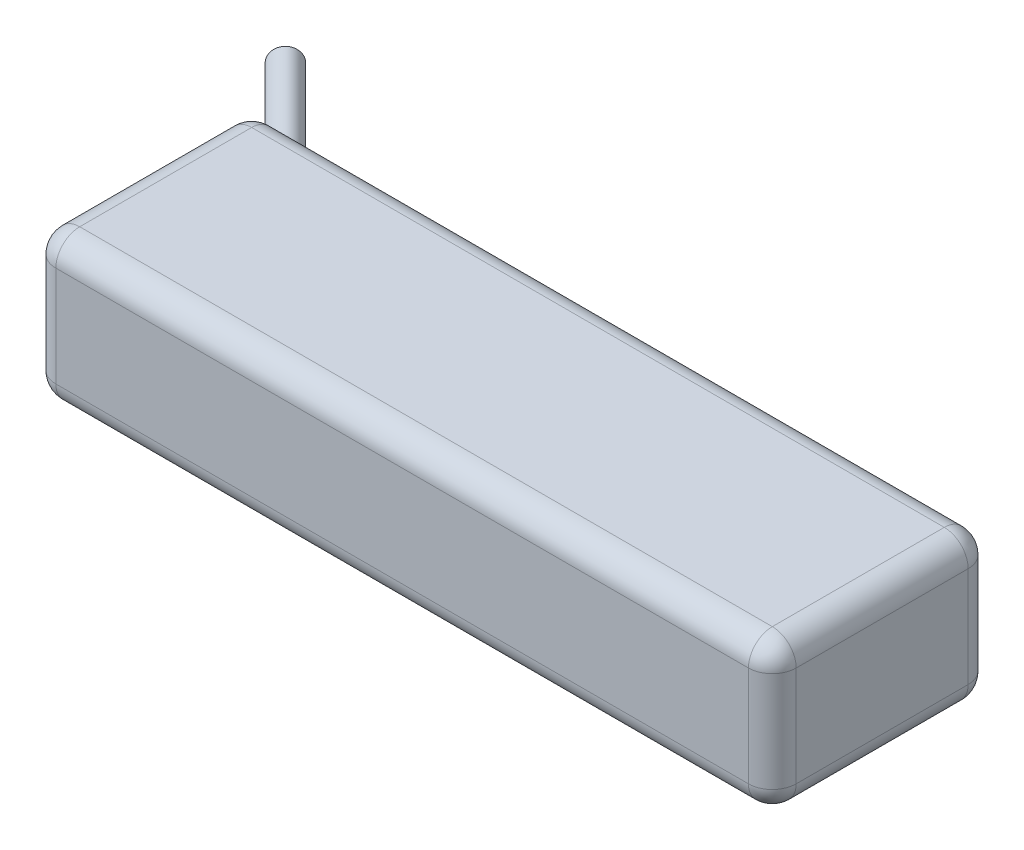
ISO-10303-21;
HEADER;
FILE_DESCRIPTION(('STEP AP214'),'2;1');
FILE_NAME('part.step','',(''),(''),'','','');
FILE_SCHEMA(('AUTOMOTIVE_DESIGN { 1 0 10303 214 1 1 1 1 }'));
ENDSEC;
DATA;
#1=APPLICATION_CONTEXT('core data for automotive mechanical design processes');
#2=APPLICATION_PROTOCOL_DEFINITION('international standard','automotive_design',2000,#1);
#3=PRODUCT_CONTEXT('',#1,'mechanical');
#4=PRODUCT('Part','Part','',(#3));
#5=PRODUCT_RELATED_PRODUCT_CATEGORY('part','',(#4));
#6=PRODUCT_DEFINITION_FORMATION('','',#4);
#7=PRODUCT_DEFINITION_CONTEXT('part definition',#1,'design');
#8=PRODUCT_DEFINITION('design','',#6,#7);
#9=PRODUCT_DEFINITION_SHAPE('','',#8);
#10=(LENGTH_UNIT() NAMED_UNIT(*) SI_UNIT(.MILLI.,.METRE.));
#11=(NAMED_UNIT(*) PLANE_ANGLE_UNIT() SI_UNIT($,.RADIAN.));
#12=(NAMED_UNIT(*) SI_UNIT($,.STERADIAN.) SOLID_ANGLE_UNIT());
#13=UNCERTAINTY_MEASURE_WITH_UNIT(LENGTH_MEASURE(1.E-05),#10,'distance_accuracy_value','');
#14=(GEOMETRIC_REPRESENTATION_CONTEXT(3) GLOBAL_UNCERTAINTY_ASSIGNED_CONTEXT((#13)) GLOBAL_UNIT_ASSIGNED_CONTEXT((#10,
#11,#12)) REPRESENTATION_CONTEXT('',''));
#15=CARTESIAN_POINT('',(0.,0.,0.));
#16=DIRECTION('',(0.,0.,1.));
#17=DIRECTION('',(1.,0.,0.));
#18=AXIS2_PLACEMENT_3D('',#15,#16,#17);
#19=CARTESIAN_POINT('',(77.5,15.5,-23.));
#20=DIRECTION('',(-1.,0.,0.));
#21=DIRECTION('',(0.,0.,1.));
#22=AXIS2_PLACEMENT_3D('',#19,#20,#21);
#23=PLANE('',#22);
#24=DIRECTION('',(0.,-1.,0.));
#25=VECTOR('',#24,1.);
#26=CARTESIAN_POINT('',(77.5,15.5,18.));
#27=LINE('',#26,#25);
#28=CARTESIAN_POINT('',(77.5,10.5,18.));
#29=VERTEX_POINT('',#28);
#30=CARTESIAN_POINT('',(77.5,-10.5,18.));
#31=VERTEX_POINT('',#30);
#32=EDGE_CURVE('E205',#29,#31,#27,.T.);
#33=ORIENTED_EDGE('',*,*,#32,.T.);
#34=DIRECTION('',(0.,0.,-1.));
#35=VECTOR('',#34,1.);
#36=CARTESIAN_POINT('',(77.5,-10.5,-23.));
#37=LINE('',#36,#35);
#38=CARTESIAN_POINT('',(77.5,-10.5,-18.));
#39=VERTEX_POINT('',#38);
#40=EDGE_CURVE('E210',#31,#39,#37,.T.);
#41=ORIENTED_EDGE('',*,*,#40,.T.);
#42=DIRECTION('',(0.,-1.,0.));
#43=VECTOR('',#42,1.);
#44=CARTESIAN_POINT('',(77.5,15.5,-18.));
#45=LINE('',#44,#43);
#46=CARTESIAN_POINT('',(77.5,10.5,-18.));
#47=VERTEX_POINT('',#46);
#48=EDGE_CURVE('E207',#39,#47,#45,.F.);
#49=ORIENTED_EDGE('',*,*,#48,.T.);
#50=DIRECTION('',(0.,0.,-1.));
#51=VECTOR('',#50,1.);
#52=CARTESIAN_POINT('',(77.5,10.5,23.));
#53=LINE('',#52,#51);
#54=EDGE_CURVE('E203',#47,#29,#53,.F.);
#55=ORIENTED_EDGE('',*,*,#54,.T.);
#56=EDGE_LOOP('',(#33,#41,#49,#55));
#57=FACE_BOUND('',#56,.T.);
#58=ADVANCED_FACE('F41',(#57),#23,.F.);
#59=CARTESIAN_POINT('',(-77.5,15.5,-23.));
#60=DIRECTION('',(0.,0.,1.));
#61=DIRECTION('',(1.,0.,0.));
#62=AXIS2_PLACEMENT_3D('',#59,#60,#61);
#63=PLANE('',#62);
#64=CARTESIAN_POINT('',(-70.4289321881345,-6.,-23.));
#65=DIRECTION('',(0.,0.,1.));
#66=DIRECTION('',(1.,0.,0.));
#67=AXIS2_PLACEMENT_3D('',#64,#65,#66);
#68=ELLIPSE('',#67,4.24264068711925,2.99999999999999);
#69=CARTESIAN_POINT('',(-67.4999999999999,-3.82959033391061,-23.));
#70=VERTEX_POINT('',#69);
#71=CARTESIAN_POINT('',(-72.5,-3.38172975815573,-23.));
#72=VERTEX_POINT('',#71);
#73=EDGE_CURVE('E164',#70,#72,#68,.T.);
#74=ORIENTED_EDGE('',*,*,#73,.T.);
#75=DIRECTION('',(0.,-1.,0.));
#76=VECTOR('',#75,1.);
#77=CARTESIAN_POINT('',(-72.5,15.5,-23.));
#78=LINE('',#77,#76);
#79=CARTESIAN_POINT('',(-72.5,3.3817297581557,-23.));
#80=VERTEX_POINT('',#79);
#81=EDGE_CURVE('E201',#72,#80,#78,.F.);
#82=ORIENTED_EDGE('',*,*,#81,.T.);
#83=CARTESIAN_POINT('',(-70.4289321881345,6.,-23.));
#84=DIRECTION('',(0.,0.,1.));
#85=DIRECTION('',(1.,0.,0.));
#86=AXIS2_PLACEMENT_3D('',#83,#84,#85);
#87=ELLIPSE('',#86,4.24264068711927,3.);
#88=CARTESIAN_POINT('',(-67.4999999999999,3.82959033391058,-23.));
#89=VERTEX_POINT('',#88);
#90=EDGE_CURVE('E188',#80,#89,#87,.T.);
#91=ORIENTED_EDGE('',*,*,#90,.T.);
#92=DIRECTION('',(0.,1.,0.));
#93=VECTOR('',#92,1.);
#94=CARTESIAN_POINT('',(-67.4999999999999,15.5,-23.));
#95=LINE('',#94,#93);
#96=CARTESIAN_POINT('',(-67.4999999999999,8.17040966608942,-23.));
#97=VERTEX_POINT('',#96);
#98=EDGE_CURVE('E184',#89,#97,#95,.T.);
#99=ORIENTED_EDGE('',*,*,#98,.T.);
#100=CARTESIAN_POINT('',(-72.5,8.61827024184429,-23.));
#101=VERTEX_POINT('',#100);
#102=EDGE_CURVE('E170',#97,#101,#87,.T.);
#103=ORIENTED_EDGE('',*,*,#102,.T.);
#104=DIRECTION('',(0.,-1.,0.));
#105=VECTOR('',#104,1.);
#106=CARTESIAN_POINT('',(-72.5,15.5,-23.));
#107=LINE('',#106,#105);
#108=CARTESIAN_POINT('',(-72.5,10.5,-23.));
#109=VERTEX_POINT('',#108);
#110=EDGE_CURVE('E193',#101,#109,#107,.F.);
#111=ORIENTED_EDGE('',*,*,#110,.T.);
#112=DIRECTION('',(-1.,0.,0.));
#113=VECTOR('',#112,1.);
#114=CARTESIAN_POINT('',(77.5,10.5,-23.));
#115=LINE('',#114,#113);
#116=CARTESIAN_POINT('',(72.5,10.5,-23.));
#117=VERTEX_POINT('',#116);
#118=EDGE_CURVE('E191',#109,#117,#115,.F.);
#119=ORIENTED_EDGE('',*,*,#118,.T.);
#120=DIRECTION('',(0.,-1.,0.));
#121=VECTOR('',#120,1.);
#122=CARTESIAN_POINT('',(72.5,15.5,-23.));
#123=LINE('',#122,#121);
#124=CARTESIAN_POINT('',(72.5,-10.5,-23.));
#125=VERTEX_POINT('',#124);
#126=EDGE_CURVE('E195',#117,#125,#123,.T.);
#127=ORIENTED_EDGE('',*,*,#126,.T.);
#128=DIRECTION('',(-1.,0.,0.));
#129=VECTOR('',#128,1.);
#130=CARTESIAN_POINT('',(-77.5,-10.5,-23.));
#131=LINE('',#130,#129);
#132=CARTESIAN_POINT('',(-72.5,-10.5,-23.));
#133=VERTEX_POINT('',#132);
#134=EDGE_CURVE('E198',#125,#133,#131,.T.);
#135=ORIENTED_EDGE('',*,*,#134,.T.);
#136=DIRECTION('',(0.,-1.,0.));
#137=VECTOR('',#136,1.);
#138=CARTESIAN_POINT('',(-72.5,15.5,-23.));
#139=LINE('',#138,#137);
#140=CARTESIAN_POINT('',(-72.5,-8.61827024184429,-23.));
#141=VERTEX_POINT('',#140);
#142=EDGE_CURVE('E160',#133,#141,#139,.F.);
#143=ORIENTED_EDGE('',*,*,#142,.T.);
#144=CARTESIAN_POINT('',(-67.4999999999999,-8.1704096660894,-23.));
#145=VERTEX_POINT('',#144);
#146=EDGE_CURVE('E154',#141,#145,#68,.T.);
#147=ORIENTED_EDGE('',*,*,#146,.T.);
#148=DIRECTION('',(0.,1.,0.));
#149=VECTOR('',#148,1.);
#150=CARTESIAN_POINT('',(-67.4999999999999,15.5,-23.));
#151=LINE('',#150,#149);
#152=EDGE_CURVE('E158',#145,#70,#151,.T.);
#153=ORIENTED_EDGE('',*,*,#152,.T.);
#154=EDGE_LOOP('',(#74,#82,#91,#99,#103,#111,#119,#127,#135,#143,#147,#153));
#155=FACE_BOUND('',#154,.T.);
#156=ADVANCED_FACE('F157',(#155),#63,.F.);
#157=CARTESIAN_POINT('',(-77.5,15.5,-23.));
#158=DIRECTION('',(1.,0.,0.));
#159=DIRECTION('',(0.,0.,-1.));
#160=AXIS2_PLACEMENT_3D('',#157,#158,#159);
#161=PLANE('',#160);
#162=DIRECTION('',(0.,-1.,0.));
#163=VECTOR('',#162,1.);
#164=CARTESIAN_POINT('',(-77.5,15.5,-18.));
#165=LINE('',#164,#163);
#166=CARTESIAN_POINT('',(-77.5,10.5,-18.));
#167=VERTEX_POINT('',#166);
#168=CARTESIAN_POINT('',(-77.5,-10.5,-18.));
#169=VERTEX_POINT('',#168);
#170=EDGE_CURVE('E216',#167,#169,#165,.T.);
#171=ORIENTED_EDGE('',*,*,#170,.T.);
#172=DIRECTION('',(0.,0.,1.));
#173=VECTOR('',#172,1.);
#174=CARTESIAN_POINT('',(-77.5,-10.5,-23.));
#175=LINE('',#174,#173);
#176=CARTESIAN_POINT('',(-77.5,-10.5,18.));
#177=VERTEX_POINT('',#176);
#178=EDGE_CURVE('E219',#169,#177,#175,.T.);
#179=ORIENTED_EDGE('',*,*,#178,.T.);
#180=DIRECTION('',(0.,-1.,0.));
#181=VECTOR('',#180,1.);
#182=CARTESIAN_POINT('',(-77.5,15.5,18.));
#183=LINE('',#182,#181);
#184=CARTESIAN_POINT('',(-77.5,10.5,18.));
#185=VERTEX_POINT('',#184);
#186=EDGE_CURVE('E214',#177,#185,#183,.F.);
#187=ORIENTED_EDGE('',*,*,#186,.T.);
#188=DIRECTION('',(0.,0.,1.));
#189=VECTOR('',#188,1.);
#190=CARTESIAN_POINT('',(-77.5,10.5,-23.));
#191=LINE('',#190,#189);
#192=EDGE_CURVE('E212',#185,#167,#191,.F.);
#193=ORIENTED_EDGE('',*,*,#192,.T.);
#194=EDGE_LOOP('',(#171,#179,#187,#193));
#195=FACE_BOUND('',#194,.T.);
#196=ADVANCED_FACE('F289',(#195),#161,.F.);
#197=CARTESIAN_POINT('',(-77.5,15.5,23.));
#198=DIRECTION('',(0.,0.,-1.));
#199=DIRECTION('',(-1.,0.,0.));
#200=AXIS2_PLACEMENT_3D('',#197,#198,#199);
#201=PLANE('',#200);
#202=DIRECTION('',(0.,-1.,0.));
#203=VECTOR('',#202,1.);
#204=CARTESIAN_POINT('',(-72.5,15.5,23.));
#205=LINE('',#204,#203);
#206=CARTESIAN_POINT('',(-72.5,10.5,23.));
#207=VERTEX_POINT('',#206);
#208=CARTESIAN_POINT('',(-72.5,-10.5,23.));
#209=VERTEX_POINT('',#208);
#210=EDGE_CURVE('E225',#207,#209,#205,.T.);
#211=ORIENTED_EDGE('',*,*,#210,.T.);
#212=DIRECTION('',(1.,0.,0.));
#213=VECTOR('',#212,1.);
#214=CARTESIAN_POINT('',(-77.5,-10.5,23.));
#215=LINE('',#214,#213);
#216=CARTESIAN_POINT('',(72.5,-10.5,23.));
#217=VERTEX_POINT('',#216);
#218=EDGE_CURVE('E228',#209,#217,#215,.T.);
#219=ORIENTED_EDGE('',*,*,#218,.T.);
#220=DIRECTION('',(0.,-1.,0.));
#221=VECTOR('',#220,1.);
#222=CARTESIAN_POINT('',(72.5,15.5,23.));
#223=LINE('',#222,#221);
#224=CARTESIAN_POINT('',(72.5,10.5,23.));
#225=VERTEX_POINT('',#224);
#226=EDGE_CURVE('E223',#217,#225,#223,.F.);
#227=ORIENTED_EDGE('',*,*,#226,.T.);
#228=DIRECTION('',(1.,0.,0.));
#229=VECTOR('',#228,1.);
#230=CARTESIAN_POINT('',(-77.5,10.5,23.));
#231=LINE('',#230,#229);
#232=EDGE_CURVE('E221',#225,#207,#231,.F.);
#233=ORIENTED_EDGE('',*,*,#232,.T.);
#234=EDGE_LOOP('',(#211,#219,#227,#233));
#235=FACE_BOUND('',#234,.T.);
#236=ADVANCED_FACE('F283',(#235),#201,.F.);
#237=CARTESIAN_POINT('',(0.,15.5,0.));
#238=DIRECTION('',(0.,1.,0.));
#239=DIRECTION('',(0.,0.,1.));
#240=AXIS2_PLACEMENT_3D('',#237,#238,#239);
#241=PLANE('',#240);
#242=DIRECTION('',(0.,0.,1.));
#243=VECTOR('',#242,1.);
#244=CARTESIAN_POINT('',(-72.5,15.5,23.));
#245=LINE('',#244,#243);
#246=CARTESIAN_POINT('',(-72.5,15.5,-18.));
#247=VERTEX_POINT('',#246);
#248=CARTESIAN_POINT('',(-72.5,15.5,18.));
#249=VERTEX_POINT('',#248);
#250=EDGE_CURVE('E58',#247,#249,#245,.T.);
#251=ORIENTED_EDGE('',*,*,#250,.T.);
#252=DIRECTION('',(1.,0.,0.));
#253=VECTOR('',#252,1.);
#254=CARTESIAN_POINT('',(77.5,15.5,18.));
#255=LINE('',#254,#253);
#256=CARTESIAN_POINT('',(72.5,15.5,18.));
#257=VERTEX_POINT('',#256);
#258=EDGE_CURVE('E243',#249,#257,#255,.T.);
#259=ORIENTED_EDGE('',*,*,#258,.T.);
#260=DIRECTION('',(0.,0.,-1.));
#261=VECTOR('',#260,1.);
#262=CARTESIAN_POINT('',(72.5,15.5,-23.));
#263=LINE('',#262,#261);
#264=CARTESIAN_POINT('',(72.5,15.5,-18.));
#265=VERTEX_POINT('',#264);
#266=EDGE_CURVE('E239',#257,#265,#263,.T.);
#267=ORIENTED_EDGE('',*,*,#266,.T.);
#268=DIRECTION('',(-1.,0.,0.));
#269=VECTOR('',#268,1.);
#270=CARTESIAN_POINT('',(-77.5,15.5,-18.));
#271=LINE('',#270,#269);
#272=EDGE_CURVE('E63',#265,#247,#271,.T.);
#273=ORIENTED_EDGE('',*,*,#272,.T.);
#274=EDGE_LOOP('',(#251,#259,#267,#273));
#275=FACE_BOUND('',#274,.T.);
#276=ADVANCED_FACE('F280',(#275),#241,.T.);
#277=CARTESIAN_POINT('',(0.,-15.5,0.));
#278=DIRECTION('',(0.,1.,0.));
#279=DIRECTION('',(0.,0.,1.));
#280=AXIS2_PLACEMENT_3D('',#277,#278,#279);
#281=PLANE('',#280);
#282=DIRECTION('',(0.,0.,1.));
#283=VECTOR('',#282,1.);
#284=CARTESIAN_POINT('',(-72.5,-15.5,0.));
#285=LINE('',#284,#283);
#286=CARTESIAN_POINT('',(-72.5,-15.5,18.));
#287=VERTEX_POINT('',#286);
#288=CARTESIAN_POINT('',(-72.5,-15.5,-18.));
#289=VERTEX_POINT('',#288);
#290=EDGE_CURVE('E234',#287,#289,#285,.F.);
#291=ORIENTED_EDGE('',*,*,#290,.T.);
#292=DIRECTION('',(-1.,0.,0.));
#293=VECTOR('',#292,1.);
#294=CARTESIAN_POINT('',(0.,-15.5,-18.));
#295=LINE('',#294,#293);
#296=CARTESIAN_POINT('',(72.5,-15.5,-18.));
#297=VERTEX_POINT('',#296);
#298=EDGE_CURVE('E236',#289,#297,#295,.F.);
#299=ORIENTED_EDGE('',*,*,#298,.T.);
#300=DIRECTION('',(0.,0.,-1.));
#301=VECTOR('',#300,1.);
#302=CARTESIAN_POINT('',(72.5,-15.5,0.));
#303=LINE('',#302,#301);
#304=CARTESIAN_POINT('',(72.5,-15.5,18.));
#305=VERTEX_POINT('',#304);
#306=EDGE_CURVE('E230',#297,#305,#303,.F.);
#307=ORIENTED_EDGE('',*,*,#306,.T.);
#308=DIRECTION('',(1.,0.,0.));
#309=VECTOR('',#308,1.);
#310=CARTESIAN_POINT('',(0.,-15.5,18.));
#311=LINE('',#310,#309);
#312=EDGE_CURVE('E232',#305,#287,#311,.F.);
#313=ORIENTED_EDGE('',*,*,#312,.T.);
#314=EDGE_LOOP('',(#291,#299,#307,#313));
#315=FACE_BOUND('',#314,.T.);
#316=ADVANCED_FACE('F278',(#315),#281,.F.);
#317=CARTESIAN_POINT('',(-90.1776695296636,6.,-42.7487373415292));
#318=DIRECTION('',(0.707106781186544,0.,0.707106781186551));
#319=DIRECTION('',(0.707106781186551,0.,-0.707106781186544));
#320=AXIS2_PLACEMENT_3D('',#317,#318,#319);
#321=CYLINDRICAL_SURFACE('',#320,3.);
#322=CARTESIAN_POINT('',(-90.1776695296636,6.,-42.7487373415292));
#323=DIRECTION('',(0.707106781186544,0.,0.707106781186551));
#324=DIRECTION('',(0.707106781186551,0.,-0.707106781186544));
#325=AXIS2_PLACEMENT_3D('',#322,#323,#324);
#326=CIRCLE('',#325,3.);
#327=CARTESIAN_POINT('',(-88.0563491861039,6.,-44.8700576850888));
#328=VERTEX_POINT('',#327);
#329=EDGE_CURVE('E181',#328,#328,#326,.T.);
#330=ORIENTED_EDGE('',*,*,#329,.T.);
#331=EDGE_LOOP('',(#330));
#332=FACE_BOUND('',#331,.T.);
#333=ORIENTED_EDGE('',*,*,#102,.F.);
#334=CARTESIAN_POINT('',(-68.9644660940672,6.,-21.5355339059327));
#335=DIRECTION('',(0.707106781186544,0.,0.707106781186551));
#336=DIRECTION('',(0.707106781186551,0.,-0.707106781186544));
#337=AXIS2_PLACEMENT_3D('',#334,#335,#336);
#338=CIRCLE('',#337,3.);
#339=EDGE_CURVE('E176',#89,#97,#338,.T.);
#340=ORIENTED_EDGE('',*,*,#339,.F.);
#341=ORIENTED_EDGE('',*,*,#90,.F.);
#342=CARTESIAN_POINT('',(-72.5,3.3817297581557,-23.));
#343=CARTESIAN_POINT('',(-72.5742723367273,3.41108832496102,-23.0000159399462));
#344=CARTESIAN_POINT('',(-72.6476207025028,3.44284189234237,-22.9983455721439));
#345=CARTESIAN_POINT('',(-72.7918514548512,3.51135555776492,-22.9919929695657));
#346=CARTESIAN_POINT('',(-72.8627324692063,3.54811838757358,-22.987309086166));
#347=CARTESIAN_POINT('',(-73.0013738349952,3.62686159193329,-22.9752869767334));
#348=CARTESIAN_POINT('',(-73.0691320776828,3.66884542336693,-22.9679469858548));
#349=CARTESIAN_POINT('',(-73.2008044407651,3.7580513502681,-22.9510883121884));
#350=CARTESIAN_POINT('',(-73.2647194086501,3.80527228430799,-22.9415701119641));
#351=CARTESIAN_POINT('',(-73.3883498792829,3.90508416188707,-22.9208515990757));
#352=CARTESIAN_POINT('',(-73.4480477003386,3.95769568272804,-22.9096447576015));
#353=CARTESIAN_POINT('',(-73.5624289240457,4.06794124194849,-22.8861698458924));
#354=CARTESIAN_POINT('',(-73.6171104014602,4.12557719225443,-22.8739013716917));
#355=CARTESIAN_POINT('',(-73.720877648095,4.24542484669456,-22.8489486158682));
#356=CARTESIAN_POINT('',(-73.7699731825568,4.30762824272717,-22.8362651113942));
#357=CARTESIAN_POINT('',(-73.8623256924469,4.43626971139602,-22.8110662623183));
#358=CARTESIAN_POINT('',(-73.9055805192486,4.50270932925477,-22.7985509811173));
#359=CARTESIAN_POINT('',(-74.0216641364888,4.70003719530852,-22.7634914472142));
#360=CARTESIAN_POINT('',(-74.0866844429277,4.83580851525652,-22.7419004637254));
#361=CARTESIAN_POINT('',(-74.1938158361093,5.11688746130414,-22.7047030515143));
#362=CARTESIAN_POINT('',(-74.2359108140236,5.26220171275287,-22.6891008331548));
#363=CARTESIAN_POINT('',(-74.2969896532276,5.55896345294547,-22.6660375615635));
#364=CARTESIAN_POINT('',(-74.315863433376,5.71043666512147,-22.6586153029766));
#365=CARTESIAN_POINT('',(-74.3300464396259,6.01461913202763,-22.6530623769069));
#366=CARTESIAN_POINT('',(-74.3253590100612,6.1673282082643,-22.6549303907405));
#367=CARTESIAN_POINT('',(-74.2922105447137,6.47195434588734,-22.6677940262898));
#368=CARTESIAN_POINT('',(-74.2634148923934,6.62382980628909,-22.6789181066376));
#369=CARTESIAN_POINT('',(-74.1817621463717,6.92018488185417,-22.7088801014918));
#370=CARTESIAN_POINT('',(-74.1289053741197,7.06466459579382,-22.7277179129446));
#371=CARTESIAN_POINT('',(-74.0001936008059,7.3409699630706,-22.7701102706688));
#372=CARTESIAN_POINT('',(-73.9245059269818,7.47287879044457,-22.793630089844));
#373=CARTESIAN_POINT('',(-73.7514983668244,7.72139788663652,-22.8416696485936));
#374=CARTESIAN_POINT('',(-73.6541856386271,7.83801319751599,-22.8661890551055));
#375=CARTESIAN_POINT('',(-73.4423809961509,8.051467207762,-22.9115618130799));
#376=CARTESIAN_POINT('',(-73.3281831635034,8.14858795941213,-22.9324667324496));
#377=CARTESIAN_POINT('',(-73.0852699031232,8.32409759288815,-22.9671368182234));
#378=CARTESIAN_POINT('',(-72.9565582829987,8.40249137087535,-22.9809038519294));
#379=CARTESIAN_POINT('',(-72.7704268742803,8.49890371404055,-22.9929620481587));
#380=CARTESIAN_POINT('',(-72.717138368038,8.52469339430982,-22.9955748798162));
#381=CARTESIAN_POINT('',(-72.6094069619065,8.57350232254528,-22.9990921077681));
#382=CARTESIAN_POINT('',(-72.5549671777073,8.59652814260913,-23.0000006351527));
#383=CARTESIAN_POINT('',(-72.5,8.61827024184429,-23.));
#384=B_SPLINE_CURVE_WITH_KNOTS('',3,(#342,#343,#344,#345,#346,#347,#348,#349,#350,#351,#352,
#353,#354,#355,#356,#357,#358,#359,#360,#361,#362,#363,#364,#365,#366,#367,#368,#369,#370,#371,
#372,#373,#374,#375,#376,#377,#378,#379,#380,#381,#382,#383),.UNSPECIFIED.,.F.,.F.,(4,2,2,2,2,2,
2,2,2,2,2,2,2,2,2,2,2,2,2,2,4),(0.,0.239566378314003,0.479263929350949,0.719121040311207,
0.958925064336937,1.19968123556778,1.44052942407659,1.68094987784811,1.92145853575557,
2.37534443151219,2.82954884690596,3.2858982444013,3.74218286841549,4.20490767925687,
4.66762630841185,5.12703284251332,5.58628753380606,6.03832326189554,6.49024067572018,
6.66794128742332,6.845210608445),.UNSPECIFIED.);
#385=EDGE_CURVE('E11',#80,#101,#384,.T.);
#386=ORIENTED_EDGE('',*,*,#385,.T.);
#387=EDGE_LOOP('',(#333,#340,#341,#386));
#388=FACE_BOUND('',#387,.T.);
#389=ADVANCED_FACE('F273',(#332,#388),#321,.T.);
#390=CARTESIAN_POINT('',(-68.9644660940672,6.,-21.5355339059327));
#391=DIRECTION('',(0.707106781186544,0.,0.707106781186551));
#392=DIRECTION('',(0.707106781186551,0.,-0.707106781186544));
#393=AXIS2_PLACEMENT_3D('',#390,#391,#392);
#394=PLANE('',#393);
#395=ORIENTED_EDGE('',*,*,#98,.F.);
#396=ORIENTED_EDGE('',*,*,#339,.T.);
#397=EDGE_LOOP('',(#395,#396));
#398=FACE_BOUND('',#397,.T.);
#399=ADVANCED_FACE('F270',(#398),#394,.T.);
#400=CARTESIAN_POINT('',(-90.1776695296636,6.,-42.7487373415292));
#401=DIRECTION('',(0.707106781186544,0.,0.707106781186551));
#402=DIRECTION('',(0.707106781186551,0.,-0.707106781186544));
#403=AXIS2_PLACEMENT_3D('',#400,#401,#402);
#404=PLANE('',#403);
#405=ORIENTED_EDGE('',*,*,#329,.F.);
#406=EDGE_LOOP('',(#405));
#407=FACE_BOUND('',#406,.T.);
#408=ADVANCED_FACE('F265',(#407),#404,.F.);
#409=CARTESIAN_POINT('',(-90.1776695296636,-6.,-42.7487373415292));
#410=DIRECTION('',(0.707106781186544,0.,0.707106781186551));
#411=DIRECTION('',(0.707106781186551,0.,-0.707106781186544));
#412=AXIS2_PLACEMENT_3D('',#409,#410,#411);
#413=CYLINDRICAL_SURFACE('',#412,2.99999999999999);
#414=CARTESIAN_POINT('',(-90.1776695296636,-6.,-42.7487373415292));
#415=DIRECTION('',(0.707106781186544,0.,0.707106781186551));
#416=DIRECTION('',(0.707106781186551,0.,-0.707106781186544));
#417=AXIS2_PLACEMENT_3D('',#414,#415,#416);
#418=CIRCLE('',#417,2.99999999999999);
#419=CARTESIAN_POINT('',(-88.0563491861039,-6.,-44.8700576850888));
#420=VERTEX_POINT('',#419);
#421=EDGE_CURVE('E173',#420,#420,#418,.T.);
#422=ORIENTED_EDGE('',*,*,#421,.T.);
#423=EDGE_LOOP('',(#422));
#424=FACE_BOUND('',#423,.T.);
#425=ORIENTED_EDGE('',*,*,#73,.F.);
#426=CARTESIAN_POINT('',(-68.9644660940672,-6.,-21.5355339059327));
#427=DIRECTION('',(0.707106781186544,0.,0.707106781186551));
#428=DIRECTION('',(0.707106781186551,0.,-0.707106781186544));
#429=AXIS2_PLACEMENT_3D('',#426,#427,#428);
#430=CIRCLE('',#429,2.99999999999999);
#431=EDGE_CURVE('E168',#145,#70,#430,.T.);
#432=ORIENTED_EDGE('',*,*,#431,.F.);
#433=ORIENTED_EDGE('',*,*,#146,.F.);
#434=CARTESIAN_POINT('',(-72.5,-8.61827024184429,-23.));
#435=CARTESIAN_POINT('',(-72.5742723367273,-8.58891167503896,-23.0000159399462));
#436=CARTESIAN_POINT('',(-72.6476207025028,-8.55715810765762,-22.9983455721439));
#437=CARTESIAN_POINT('',(-72.7918514548512,-8.48864444223507,-22.9919929695657));
#438=CARTESIAN_POINT('',(-72.8627324692063,-8.45188161242641,-22.987309086166));
#439=CARTESIAN_POINT('',(-73.0013738349952,-8.3731384080667,-22.9752869767334));
#440=CARTESIAN_POINT('',(-73.0691320776828,-8.33115457663306,-22.9679469858548));
#441=CARTESIAN_POINT('',(-73.2008044407651,-8.24194864973189,-22.9510883121884));
#442=CARTESIAN_POINT('',(-73.2647194086501,-8.194727715692,-22.9415701119641));
#443=CARTESIAN_POINT('',(-73.3883498792829,-8.09491583811292,-22.9208515990757));
#444=CARTESIAN_POINT('',(-73.4480477003386,-8.04230431727195,-22.9096447576015));
#445=CARTESIAN_POINT('',(-73.5624289240457,-7.9320587580515,-22.8861698458924));
#446=CARTESIAN_POINT('',(-73.6171104014602,-7.87442280774556,-22.8739013716917));
#447=CARTESIAN_POINT('',(-73.720877648095,-7.75457515330543,-22.8489486158683));
#448=CARTESIAN_POINT('',(-73.7699731825568,-7.69237175727282,-22.8362651113942));
#449=CARTESIAN_POINT('',(-73.8623256924469,-7.56373028860398,-22.8110662623184));
#450=CARTESIAN_POINT('',(-73.9055805192486,-7.49729067074523,-22.7985509811173));
#451=CARTESIAN_POINT('',(-74.0216641364887,-7.29996280469149,-22.7634914472142));
#452=CARTESIAN_POINT('',(-74.0866844429276,-7.16419148474348,-22.7419004637254));
#453=CARTESIAN_POINT('',(-74.1938158361093,-6.88311253869587,-22.7047030515143));
#454=CARTESIAN_POINT('',(-74.2359108140236,-6.73779828724713,-22.6891008331548));
#455=CARTESIAN_POINT('',(-74.2969896532276,-6.44103654705453,-22.6660375615635));
#456=CARTESIAN_POINT('',(-74.3158634333759,-6.28956333487853,-22.6586153029766));
#457=CARTESIAN_POINT('',(-74.3300464396259,-5.98538086797238,-22.6530623769069));
#458=CARTESIAN_POINT('',(-74.3253590100612,-5.83267179173571,-22.6549303907405));
#459=CARTESIAN_POINT('',(-74.2922105447137,-5.52804565411267,-22.6677940262898));
#460=CARTESIAN_POINT('',(-74.2634148923934,-5.37617019371093,-22.6789181066376));
#461=CARTESIAN_POINT('',(-74.1817621463716,-5.07981511814585,-22.7088801014918));
#462=CARTESIAN_POINT('',(-74.1289053741197,-4.93533540420619,-22.7277179129446));
#463=CARTESIAN_POINT('',(-74.0001936008059,-4.65903003692942,-22.7701102706688));
#464=CARTESIAN_POINT('',(-73.9245059269818,-4.52712120955546,-22.793630089844));
#465=CARTESIAN_POINT('',(-73.7514983668244,-4.2786021133635,-22.8416696485936));
#466=CARTESIAN_POINT('',(-73.6541856386271,-4.16198680248403,-22.8661890551055));
#467=CARTESIAN_POINT('',(-73.4423809961509,-3.94853279223802,-22.9115618130799));
#468=CARTESIAN_POINT('',(-73.3281831635034,-3.85141204058789,-22.9324667324496));
#469=CARTESIAN_POINT('',(-73.0852699031232,-3.67590240711187,-22.9671368182234));
#470=CARTESIAN_POINT('',(-72.9565582829987,-3.59750862912467,-22.9809038519294));
#471=CARTESIAN_POINT('',(-72.7704268742803,-3.50109628595947,-22.9929620481587));
#472=CARTESIAN_POINT('',(-72.717138368038,-3.4753066056902,-22.9955748798162));
#473=CARTESIAN_POINT('',(-72.6094069619065,-3.42649767745473,-22.9990921077681));
#474=CARTESIAN_POINT('',(-72.5549671777073,-3.40347185739088,-23.0000006351527));
#475=CARTESIAN_POINT('',(-72.5,-3.38172975815572,-23.));
#476=B_SPLINE_CURVE_WITH_KNOTS('',3,(#434,#435,#436,#437,#438,#439,#440,#441,#442,#443,#444,
#445,#446,#447,#448,#449,#450,#451,#452,#453,#454,#455,#456,#457,#458,#459,#460,#461,#462,#463,
#464,#465,#466,#467,#468,#469,#470,#471,#472,#473,#474,#475),.UNSPECIFIED.,.F.,.F.,(4,2,2,2,2,2,
2,2,2,2,2,2,2,2,2,2,2,2,2,2,4),(0.,0.239566378313987,0.479263929350932,0.719121040311205,
0.95892506433692,1.19968123556776,1.44052942407658,1.68094987784807,1.92145853575554,
2.37534443151216,2.82954884690594,3.28589824440127,3.74218286841545,4.20490767925682,
4.66762630841181,5.12703284251326,5.58628753380601,6.03832326189549,6.49024067572013,
6.66794128742327,6.84521060844495),.UNSPECIFIED.);
#477=EDGE_CURVE('E50',#141,#72,#476,.T.);
#478=ORIENTED_EDGE('',*,*,#477,.T.);
#479=EDGE_LOOP('',(#425,#432,#433,#478));
#480=FACE_BOUND('',#479,.T.);
#481=ADVANCED_FACE('F172',(#424,#480),#413,.T.);
#482=CARTESIAN_POINT('',(-68.9644660940672,-6.,-21.5355339059327));
#483=DIRECTION('',(0.707106781186544,0.,0.707106781186551));
#484=DIRECTION('',(0.707106781186551,0.,-0.707106781186544));
#485=AXIS2_PLACEMENT_3D('',#482,#483,#484);
#486=PLANE('',#485);
#487=ORIENTED_EDGE('',*,*,#152,.F.);
#488=ORIENTED_EDGE('',*,*,#431,.T.);
#489=EDGE_LOOP('',(#487,#488));
#490=FACE_BOUND('',#489,.T.);
#491=ADVANCED_FACE('F167',(#490),#486,.T.);
#492=CARTESIAN_POINT('',(-90.1776695296636,-6.,-42.7487373415292));
#493=DIRECTION('',(0.707106781186544,0.,0.707106781186551));
#494=DIRECTION('',(0.707106781186551,0.,-0.707106781186544));
#495=AXIS2_PLACEMENT_3D('',#492,#493,#494);
#496=PLANE('',#495);
#497=ORIENTED_EDGE('',*,*,#421,.F.);
#498=EDGE_LOOP('',(#497));
#499=FACE_BOUND('',#498,.T.);
#500=ADVANCED_FACE('F484',(#499),#496,.F.);
#501=CARTESIAN_POINT('',(-72.5,15.5,18.));
#502=DIRECTION('',(0.,-1.,0.));
#503=DIRECTION('',(0.,0.,-1.));
#504=AXIS2_PLACEMENT_3D('',#501,#502,#503);
#505=CYLINDRICAL_SURFACE('',#504,5.);
#506=CARTESIAN_POINT('',(-72.5,10.5,18.));
#507=DIRECTION('',(0.,1.,0.));
#508=DIRECTION('',(0.,0.,1.));
#509=AXIS2_PLACEMENT_3D('',#506,#507,#508);
#510=CIRCLE('',#509,5.);
#511=EDGE_CURVE('E45',#185,#207,#510,.T.);
#512=ORIENTED_EDGE('',*,*,#511,.F.);
#513=ORIENTED_EDGE('',*,*,#186,.F.);
#514=CARTESIAN_POINT('',(-72.5,-10.5,18.));
#515=DIRECTION('',(0.,-1.,0.));
#516=DIRECTION('',(0.,0.,-1.));
#517=AXIS2_PLACEMENT_3D('',#514,#515,#516);
#518=CIRCLE('',#517,5.);
#519=EDGE_CURVE('E179',#209,#177,#518,.T.);
#520=ORIENTED_EDGE('',*,*,#519,.F.);
#521=ORIENTED_EDGE('',*,*,#210,.F.);
#522=EDGE_LOOP('',(#512,#513,#520,#521));
#523=FACE_BOUND('',#522,.T.);
#524=ADVANCED_FACE('F43',(#523),#505,.T.);
#525=CARTESIAN_POINT('',(-72.5,10.5,18.));
#526=DIRECTION('',(0.,0.,1.));
#527=DIRECTION('',(1.,0.,0.));
#528=AXIS2_PLACEMENT_3D('',#525,#526,#527);
#529=SPHERICAL_SURFACE('',#528,5.);
#530=CARTESIAN_POINT('',(-72.5,10.5,18.));
#531=DIRECTION('',(0.,0.,1.));
#532=DIRECTION('',(1.,0.,0.));
#533=AXIS2_PLACEMENT_3D('',#530,#531,#532);
#534=CIRCLE('',#533,5.);
#535=EDGE_CURVE('E367',#185,#249,#534,.F.);
#536=ORIENTED_EDGE('',*,*,#535,.F.);
#537=ORIENTED_EDGE('',*,*,#511,.T.);
#538=CARTESIAN_POINT('',(-72.5,10.5,18.));
#539=DIRECTION('',(-1.,0.,0.));
#540=DIRECTION('',(0.,0.,1.));
#541=AXIS2_PLACEMENT_3D('',#538,#539,#540);
#542=CIRCLE('',#541,5.);
#543=EDGE_CURVE('E370',#249,#207,#542,.F.);
#544=ORIENTED_EDGE('',*,*,#543,.F.);
#545=EDGE_LOOP('',(#536,#537,#544));
#546=FACE_BOUND('',#545,.T.);
#547=ADVANCED_FACE('F477',(#546),#529,.T.);
#548=CARTESIAN_POINT('',(-72.5,-10.5,18.));
#549=DIRECTION('',(-1.,0.,0.));
#550=DIRECTION('',(0.,0.,1.));
#551=AXIS2_PLACEMENT_3D('',#548,#549,#550);
#552=SPHERICAL_SURFACE('',#551,5.);
#553=CARTESIAN_POINT('',(-72.5,-10.5,18.));
#554=DIRECTION('',(-1.,0.,0.));
#555=DIRECTION('',(0.,0.,1.));
#556=AXIS2_PLACEMENT_3D('',#553,#554,#555);
#557=CIRCLE('',#556,5.);
#558=EDGE_CURVE('E368',#209,#287,#557,.F.);
#559=ORIENTED_EDGE('',*,*,#558,.F.);
#560=ORIENTED_EDGE('',*,*,#519,.T.);
#561=CARTESIAN_POINT('',(-72.5,-10.5,18.));
#562=DIRECTION('',(0.,0.,1.));
#563=DIRECTION('',(1.,0.,0.));
#564=AXIS2_PLACEMENT_3D('',#561,#562,#563);
#565=CIRCLE('',#564,5.);
#566=EDGE_CURVE('E362',#287,#177,#565,.F.);
#567=ORIENTED_EDGE('',*,*,#566,.F.);
#568=EDGE_LOOP('',(#559,#560,#567));
#569=FACE_BOUND('',#568,.T.);
#570=ADVANCED_FACE('F379',(#569),#552,.T.);
#571=CARTESIAN_POINT('',(0.,10.5,18.));
#572=DIRECTION('',(-1.,0.,0.));
#573=DIRECTION('',(0.,0.,1.));
#574=AXIS2_PLACEMENT_3D('',#571,#572,#573);
#575=CYLINDRICAL_SURFACE('',#574,5.);
#576=ORIENTED_EDGE('',*,*,#543,.T.);
#577=ORIENTED_EDGE('',*,*,#232,.F.);
#578=CARTESIAN_POINT('',(72.5,10.5,18.));
#579=DIRECTION('',(1.,0.,0.));
#580=DIRECTION('',(0.,0.,-1.));
#581=AXIS2_PLACEMENT_3D('',#578,#579,#580);
#582=CIRCLE('',#581,5.);
#583=EDGE_CURVE('E392',#257,#225,#582,.T.);
#584=ORIENTED_EDGE('',*,*,#583,.F.);
#585=ORIENTED_EDGE('',*,*,#258,.F.);
#586=EDGE_LOOP('',(#576,#577,#584,#585));
#587=FACE_BOUND('',#586,.T.);
#588=ADVANCED_FACE('F389',(#587),#575,.T.);
#589=CARTESIAN_POINT('',(-72.5,10.5,0.));
#590=DIRECTION('',(0.,0.,-1.));
#591=DIRECTION('',(-1.,0.,0.));
#592=AXIS2_PLACEMENT_3D('',#589,#590,#591);
#593=CYLINDRICAL_SURFACE('',#592,5.);
#594=ORIENTED_EDGE('',*,*,#535,.T.);
#595=ORIENTED_EDGE('',*,*,#250,.F.);
#596=CARTESIAN_POINT('',(-72.5,10.5,-18.));
#597=DIRECTION('',(0.,0.,-1.));
#598=DIRECTION('',(-1.,0.,0.));
#599=AXIS2_PLACEMENT_3D('',#596,#597,#598);
#600=CIRCLE('',#599,5.);
#601=EDGE_CURVE('E401',#167,#247,#600,.T.);
#602=ORIENTED_EDGE('',*,*,#601,.F.);
#603=ORIENTED_EDGE('',*,*,#192,.F.);
#604=EDGE_LOOP('',(#594,#595,#602,#603));
#605=FACE_BOUND('',#604,.T.);
#606=ADVANCED_FACE('F356',(#605),#593,.T.);
#607=CARTESIAN_POINT('',(-72.5,15.5,-18.));
#608=DIRECTION('',(0.,-1.,0.));
#609=DIRECTION('',(0.,0.,-1.));
#610=AXIS2_PLACEMENT_3D('',#607,#608,#609);
#611=CYLINDRICAL_SURFACE('',#610,5.);
#612=CARTESIAN_POINT('',(-72.5,-10.5,-18.));
#613=DIRECTION('',(0.,-1.,0.));
#614=DIRECTION('',(0.,0.,-1.));
#615=AXIS2_PLACEMENT_3D('',#612,#613,#614);
#616=CIRCLE('',#615,5.);
#617=EDGE_CURVE('E409',#169,#133,#616,.T.);
#618=ORIENTED_EDGE('',*,*,#617,.F.);
#619=ORIENTED_EDGE('',*,*,#170,.F.);
#620=CARTESIAN_POINT('',(-72.5,10.5,-18.));
#621=DIRECTION('',(0.,1.,0.));
#622=DIRECTION('',(0.,0.,1.));
#623=AXIS2_PLACEMENT_3D('',#620,#621,#622);
#624=CIRCLE('',#623,5.);
#625=EDGE_CURVE('E404',#109,#167,#624,.T.);
#626=ORIENTED_EDGE('',*,*,#625,.F.);
#627=ORIENTED_EDGE('',*,*,#110,.F.);
#628=ORIENTED_EDGE('',*,*,#385,.F.);
#629=ORIENTED_EDGE('',*,*,#81,.F.);
#630=ORIENTED_EDGE('',*,*,#477,.F.);
#631=ORIENTED_EDGE('',*,*,#142,.F.);
#632=EDGE_LOOP('',(#618,#619,#626,#627,#628,#629,#630,#631));
#633=FACE_BOUND('',#632,.T.);
#634=ADVANCED_FACE('F257',(#633),#611,.T.);
#635=CARTESIAN_POINT('',(-72.5,-10.5,-23.));
#636=DIRECTION('',(0.,0.,1.));
#637=DIRECTION('',(1.,0.,0.));
#638=AXIS2_PLACEMENT_3D('',#635,#636,#637);
#639=CYLINDRICAL_SURFACE('',#638,5.);
#640=ORIENTED_EDGE('',*,*,#566,.T.);
#641=ORIENTED_EDGE('',*,*,#178,.F.);
#642=CARTESIAN_POINT('',(-72.5,-10.5,-18.));
#643=DIRECTION('',(0.,0.,-1.));
#644=DIRECTION('',(-1.,0.,0.));
#645=AXIS2_PLACEMENT_3D('',#642,#643,#644);
#646=CIRCLE('',#645,5.);
#647=EDGE_CURVE('E412',#289,#169,#646,.T.);
#648=ORIENTED_EDGE('',*,*,#647,.F.);
#649=ORIENTED_EDGE('',*,*,#290,.F.);
#650=EDGE_LOOP('',(#640,#641,#648,#649));
#651=FACE_BOUND('',#650,.T.);
#652=ADVANCED_FACE('F349',(#651),#639,.T.);
#653=CARTESIAN_POINT('',(-77.5,-10.5,18.));
#654=DIRECTION('',(1.,0.,0.));
#655=DIRECTION('',(0.,0.,-1.));
#656=AXIS2_PLACEMENT_3D('',#653,#654,#655);
#657=CYLINDRICAL_SURFACE('',#656,5.);
#658=ORIENTED_EDGE('',*,*,#558,.T.);
#659=ORIENTED_EDGE('',*,*,#312,.F.);
#660=CARTESIAN_POINT('',(72.5,-10.5,18.));
#661=DIRECTION('',(1.,0.,0.));
#662=DIRECTION('',(0.,0.,-1.));
#663=AXIS2_PLACEMENT_3D('',#660,#661,#662);
#664=CIRCLE('',#663,5.);
#665=EDGE_CURVE('E414',#217,#305,#664,.T.);
#666=ORIENTED_EDGE('',*,*,#665,.F.);
#667=ORIENTED_EDGE('',*,*,#218,.F.);
#668=EDGE_LOOP('',(#658,#659,#666,#667));
#669=FACE_BOUND('',#668,.T.);
#670=ADVANCED_FACE('F346',(#669),#657,.T.);
#671=CARTESIAN_POINT('',(72.5,15.5,18.));
#672=DIRECTION('',(0.,-1.,0.));
#673=DIRECTION('',(0.,0.,-1.));
#674=AXIS2_PLACEMENT_3D('',#671,#672,#673);
#675=CYLINDRICAL_SURFACE('',#674,5.);
#676=CARTESIAN_POINT('',(72.5,10.5,18.));
#677=DIRECTION('',(0.,1.,0.));
#678=DIRECTION('',(0.,0.,1.));
#679=AXIS2_PLACEMENT_3D('',#676,#677,#678);
#680=CIRCLE('',#679,5.);
#681=EDGE_CURVE('E373',#225,#29,#680,.T.);
#682=ORIENTED_EDGE('',*,*,#681,.F.);
#683=ORIENTED_EDGE('',*,*,#226,.F.);
#684=CARTESIAN_POINT('',(72.5,-10.5,18.));
#685=DIRECTION('',(0.,-1.,0.));
#686=DIRECTION('',(0.,0.,-1.));
#687=AXIS2_PLACEMENT_3D('',#684,#685,#686);
#688=CIRCLE('',#687,5.);
#689=EDGE_CURVE('E417',#31,#217,#688,.T.);
#690=ORIENTED_EDGE('',*,*,#689,.F.);
#691=ORIENTED_EDGE('',*,*,#32,.F.);
#692=EDGE_LOOP('',(#682,#683,#690,#691));
#693=FACE_BOUND('',#692,.T.);
#694=ADVANCED_FACE('F342',(#693),#675,.T.);
#695=CARTESIAN_POINT('',(72.5,10.5,18.));
#696=DIRECTION('',(0.,0.,1.));
#697=DIRECTION('',(1.,0.,0.));
#698=AXIS2_PLACEMENT_3D('',#695,#696,#697);
#699=SPHERICAL_SURFACE('',#698,5.);
#700=ORIENTED_EDGE('',*,*,#583,.T.);
#701=ORIENTED_EDGE('',*,*,#681,.T.);
#702=CARTESIAN_POINT('',(72.5,10.5,18.));
#703=DIRECTION('',(0.,0.,1.));
#704=DIRECTION('',(0.,-1.,0.));
#705=AXIS2_PLACEMENT_3D('',#702,#703,#704);
#706=CIRCLE('',#705,5.);
#707=EDGE_CURVE('E400',#257,#29,#706,.F.);
#708=ORIENTED_EDGE('',*,*,#707,.F.);
#709=EDGE_LOOP('',(#700,#701,#708));
#710=FACE_BOUND('',#709,.T.);
#711=ADVANCED_FACE('F338',(#710),#699,.T.);
#712=CARTESIAN_POINT('',(-72.5,10.5,-18.));
#713=DIRECTION('',(-1.,0.,0.));
#714=DIRECTION('',(0.,0.,1.));
#715=AXIS2_PLACEMENT_3D('',#712,#713,#714);
#716=SPHERICAL_SURFACE('',#715,5.);
#717=ORIENTED_EDGE('',*,*,#625,.T.);
#718=ORIENTED_EDGE('',*,*,#601,.T.);
#719=CARTESIAN_POINT('',(-72.5,10.5,-18.));
#720=DIRECTION('',(-1.,0.,0.));
#721=DIRECTION('',(0.,0.,1.));
#722=AXIS2_PLACEMENT_3D('',#719,#720,#721);
#723=CIRCLE('',#722,5.);
#724=EDGE_CURVE('E421',#109,#247,#723,.F.);
#725=ORIENTED_EDGE('',*,*,#724,.F.);
#726=EDGE_LOOP('',(#717,#718,#725));
#727=FACE_BOUND('',#726,.T.);
#728=ADVANCED_FACE('F334',(#727),#716,.T.);
#729=CARTESIAN_POINT('',(-72.5,-10.5,-18.));
#730=DIRECTION('',(-1.,0.,0.));
#731=DIRECTION('',(0.,0.,1.));
#732=AXIS2_PLACEMENT_3D('',#729,#730,#731);
#733=SPHERICAL_SURFACE('',#732,5.);
#734=ORIENTED_EDGE('',*,*,#647,.T.);
#735=ORIENTED_EDGE('',*,*,#617,.T.);
#736=CARTESIAN_POINT('',(-72.5,-10.5,-18.));
#737=DIRECTION('',(-1.,0.,0.));
#738=DIRECTION('',(0.,0.,1.));
#739=AXIS2_PLACEMENT_3D('',#736,#737,#738);
#740=CIRCLE('',#739,5.);
#741=EDGE_CURVE('E424',#289,#133,#740,.F.);
#742=ORIENTED_EDGE('',*,*,#741,.F.);
#743=EDGE_LOOP('',(#734,#735,#742));
#744=FACE_BOUND('',#743,.T.);
#745=ADVANCED_FACE('F330',(#744),#733,.T.);
#746=CARTESIAN_POINT('',(72.5,-10.5,18.));
#747=DIRECTION('',(0.,0.,1.));
#748=DIRECTION('',(1.,0.,0.));
#749=AXIS2_PLACEMENT_3D('',#746,#747,#748);
#750=SPHERICAL_SURFACE('',#749,5.);
#751=ORIENTED_EDGE('',*,*,#689,.T.);
#752=ORIENTED_EDGE('',*,*,#665,.T.);
#753=CARTESIAN_POINT('',(72.5,-10.5,18.));
#754=DIRECTION('',(0.,0.,1.));
#755=DIRECTION('',(1.,0.,0.));
#756=AXIS2_PLACEMENT_3D('',#753,#754,#755);
#757=CIRCLE('',#756,5.);
#758=EDGE_CURVE('E427',#31,#305,#757,.F.);
#759=ORIENTED_EDGE('',*,*,#758,.F.);
#760=EDGE_LOOP('',(#751,#752,#759));
#761=FACE_BOUND('',#760,.T.);
#762=ADVANCED_FACE('F326',(#761),#750,.T.);
#763=CARTESIAN_POINT('',(72.5,10.5,0.));
#764=DIRECTION('',(0.,0.,1.));
#765=DIRECTION('',(1.,0.,0.));
#766=AXIS2_PLACEMENT_3D('',#763,#764,#765);
#767=CYLINDRICAL_SURFACE('',#766,5.);
#768=ORIENTED_EDGE('',*,*,#707,.T.);
#769=ORIENTED_EDGE('',*,*,#54,.F.);
#770=CARTESIAN_POINT('',(72.5,10.5,-18.));
#771=DIRECTION('',(0.,0.,-1.));
#772=DIRECTION('',(-1.,0.,0.));
#773=AXIS2_PLACEMENT_3D('',#770,#771,#772);
#774=CIRCLE('',#773,5.);
#775=EDGE_CURVE('E430',#265,#47,#774,.T.);
#776=ORIENTED_EDGE('',*,*,#775,.F.);
#777=ORIENTED_EDGE('',*,*,#266,.F.);
#778=EDGE_LOOP('',(#768,#769,#776,#777));
#779=FACE_BOUND('',#778,.T.);
#780=ADVANCED_FACE('F322',(#779),#767,.T.);
#781=CARTESIAN_POINT('',(0.,10.5,-18.));
#782=DIRECTION('',(1.,0.,0.));
#783=DIRECTION('',(0.,0.,-1.));
#784=AXIS2_PLACEMENT_3D('',#781,#782,#783);
#785=CYLINDRICAL_SURFACE('',#784,5.);
#786=ORIENTED_EDGE('',*,*,#724,.T.);
#787=ORIENTED_EDGE('',*,*,#272,.F.);
#788=CARTESIAN_POINT('',(72.5,10.5,-18.));
#789=DIRECTION('',(1.,0.,0.));
#790=DIRECTION('',(0.,0.,-1.));
#791=AXIS2_PLACEMENT_3D('',#788,#789,#790);
#792=CIRCLE('',#791,5.);
#793=EDGE_CURVE('E433',#117,#265,#792,.T.);
#794=ORIENTED_EDGE('',*,*,#793,.F.);
#795=ORIENTED_EDGE('',*,*,#118,.F.);
#796=EDGE_LOOP('',(#786,#787,#794,#795));
#797=FACE_BOUND('',#796,.T.);
#798=ADVANCED_FACE('F318',(#797),#785,.T.);
#799=CARTESIAN_POINT('',(-77.5,-10.5,-18.));
#800=DIRECTION('',(-1.,0.,0.));
#801=DIRECTION('',(0.,0.,1.));
#802=AXIS2_PLACEMENT_3D('',#799,#800,#801);
#803=CYLINDRICAL_SURFACE('',#802,5.);
#804=ORIENTED_EDGE('',*,*,#741,.T.);
#805=ORIENTED_EDGE('',*,*,#134,.F.);
#806=CARTESIAN_POINT('',(72.5,-10.5,-18.));
#807=DIRECTION('',(1.,0.,0.));
#808=DIRECTION('',(0.,0.,-1.));
#809=AXIS2_PLACEMENT_3D('',#806,#807,#808);
#810=CIRCLE('',#809,5.);
#811=EDGE_CURVE('E436',#297,#125,#810,.T.);
#812=ORIENTED_EDGE('',*,*,#811,.F.);
#813=ORIENTED_EDGE('',*,*,#298,.F.);
#814=EDGE_LOOP('',(#804,#805,#812,#813));
#815=FACE_BOUND('',#814,.T.);
#816=ADVANCED_FACE('F314',(#815),#803,.T.);
#817=CARTESIAN_POINT('',(72.5,-10.5,-23.));
#818=DIRECTION('',(0.,0.,-1.));
#819=DIRECTION('',(-1.,0.,0.));
#820=AXIS2_PLACEMENT_3D('',#817,#818,#819);
#821=CYLINDRICAL_SURFACE('',#820,5.);
#822=ORIENTED_EDGE('',*,*,#758,.T.);
#823=ORIENTED_EDGE('',*,*,#306,.F.);
#824=CARTESIAN_POINT('',(72.5,-10.5,-18.));
#825=DIRECTION('',(0.,0.,-1.));
#826=DIRECTION('',(-1.,0.,0.));
#827=AXIS2_PLACEMENT_3D('',#824,#825,#826);
#828=CIRCLE('',#827,5.);
#829=EDGE_CURVE('E439',#39,#297,#828,.T.);
#830=ORIENTED_EDGE('',*,*,#829,.F.);
#831=ORIENTED_EDGE('',*,*,#40,.F.);
#832=EDGE_LOOP('',(#822,#823,#830,#831));
#833=FACE_BOUND('',#832,.T.);
#834=ADVANCED_FACE('F310',(#833),#821,.T.);
#835=CARTESIAN_POINT('',(72.5,10.5,-18.));
#836=DIRECTION('',(0.,1.,0.));
#837=DIRECTION('',(0.,0.,1.));
#838=AXIS2_PLACEMENT_3D('',#835,#836,#837);
#839=SPHERICAL_SURFACE('',#838,5.);
#840=ORIENTED_EDGE('',*,*,#793,.T.);
#841=ORIENTED_EDGE('',*,*,#775,.T.);
#842=CARTESIAN_POINT('',(72.5,10.5,-18.));
#843=DIRECTION('',(0.,1.,0.));
#844=DIRECTION('',(0.,0.,1.));
#845=AXIS2_PLACEMENT_3D('',#842,#843,#844);
#846=CIRCLE('',#845,5.);
#847=EDGE_CURVE('E441',#117,#47,#846,.F.);
#848=ORIENTED_EDGE('',*,*,#847,.F.);
#849=EDGE_LOOP('',(#840,#841,#848));
#850=FACE_BOUND('',#849,.T.);
#851=ADVANCED_FACE('F306',(#850),#839,.T.);
#852=CARTESIAN_POINT('',(72.5,-10.5,-18.));
#853=DIRECTION('',(0.,-1.,0.));
#854=DIRECTION('',(0.,0.,-1.));
#855=AXIS2_PLACEMENT_3D('',#852,#853,#854);
#856=SPHERICAL_SURFACE('',#855,5.);
#857=ORIENTED_EDGE('',*,*,#829,.T.);
#858=ORIENTED_EDGE('',*,*,#811,.T.);
#859=CARTESIAN_POINT('',(72.5,-10.5,-18.));
#860=DIRECTION('',(0.,-1.,0.));
#861=DIRECTION('',(0.,0.,-1.));
#862=AXIS2_PLACEMENT_3D('',#859,#860,#861);
#863=CIRCLE('',#862,5.);
#864=EDGE_CURVE('E442',#39,#125,#863,.F.);
#865=ORIENTED_EDGE('',*,*,#864,.F.);
#866=EDGE_LOOP('',(#857,#858,#865));
#867=FACE_BOUND('',#866,.T.);
#868=ADVANCED_FACE('F302',(#867),#856,.T.);
#869=CARTESIAN_POINT('',(72.5,15.5,-18.));
#870=DIRECTION('',(0.,-1.,0.));
#871=DIRECTION('',(0.,0.,-1.));
#872=AXIS2_PLACEMENT_3D('',#869,#870,#871);
#873=CYLINDRICAL_SURFACE('',#872,5.);
#874=ORIENTED_EDGE('',*,*,#847,.T.);
#875=ORIENTED_EDGE('',*,*,#48,.F.);
#876=ORIENTED_EDGE('',*,*,#864,.T.);
#877=ORIENTED_EDGE('',*,*,#126,.F.);
#878=EDGE_LOOP('',(#874,#875,#876,#877));
#879=FACE_BOUND('',#878,.T.);
#880=ADVANCED_FACE('F299',(#879),#873,.T.);
#881=CLOSED_SHELL('',(#58,#156,#196,#236,#276,#316,#389,#399,#408,#481,#491,#500,#524,#547,#570,
#588,#606,#634,#652,#670,#694,#711,#728,#745,#762,#780,#798,#816,#834,#851,#868,#880));
#882=MANIFOLD_SOLID_BREP('B2',#881);
#883=ADVANCED_BREP_SHAPE_REPRESENTATION('',(#18,#882),#14);
#884=SHAPE_DEFINITION_REPRESENTATION(#9,#883);
ENDSEC;
END-ISO-10303-21;
